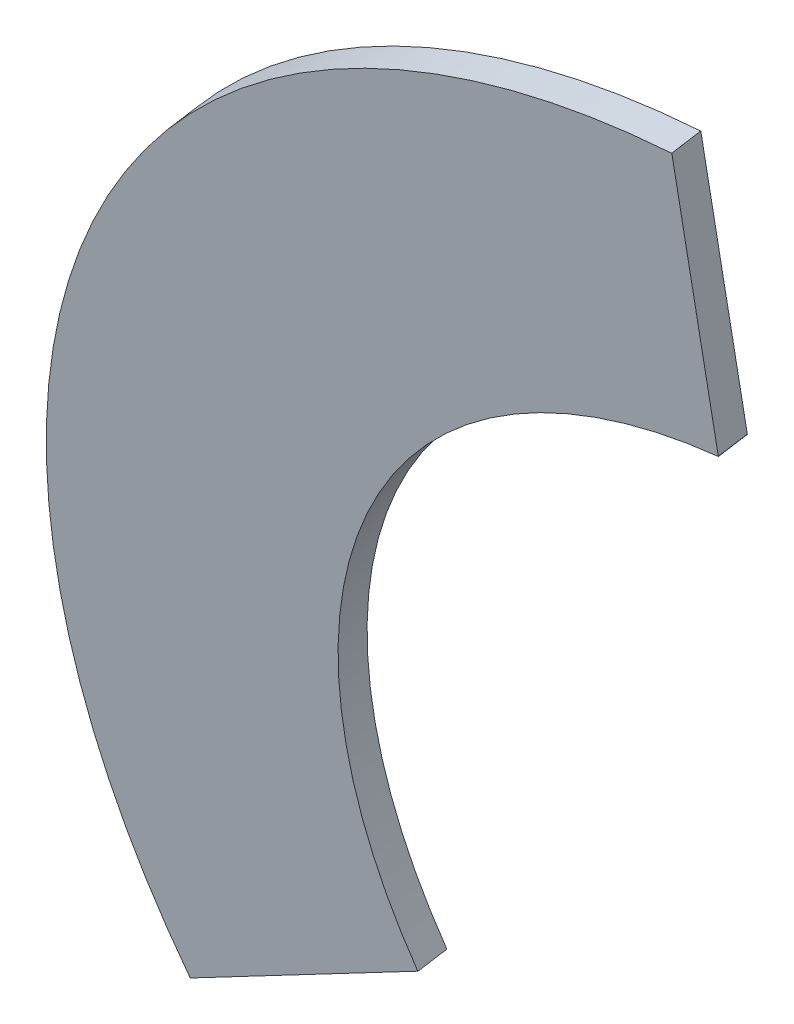
ISO-10303-21;
HEADER;
FILE_DESCRIPTION(('STEP AP214'),'2;1');
FILE_NAME('part.step','',(''),(''),'','','');
FILE_SCHEMA(('AUTOMOTIVE_DESIGN { 1 0 10303 214 1 1 1 1 }'));
ENDSEC;
DATA;
#1=APPLICATION_CONTEXT('core data for automotive mechanical design processes');
#2=APPLICATION_PROTOCOL_DEFINITION('international standard','automotive_design',2000,#1);
#3=PRODUCT_CONTEXT('',#1,'mechanical');
#4=PRODUCT('Part','Part','',(#3));
#5=PRODUCT_RELATED_PRODUCT_CATEGORY('part','',(#4));
#6=PRODUCT_DEFINITION_FORMATION('','',#4);
#7=PRODUCT_DEFINITION_CONTEXT('part definition',#1,'design');
#8=PRODUCT_DEFINITION('design','',#6,#7);
#9=PRODUCT_DEFINITION_SHAPE('','',#8);
#10=(LENGTH_UNIT() NAMED_UNIT(*) SI_UNIT(.MILLI.,.METRE.));
#11=(NAMED_UNIT(*) PLANE_ANGLE_UNIT() SI_UNIT($,.RADIAN.));
#12=(NAMED_UNIT(*) SI_UNIT($,.STERADIAN.) SOLID_ANGLE_UNIT());
#13=UNCERTAINTY_MEASURE_WITH_UNIT(LENGTH_MEASURE(1.E-05),#10,'distance_accuracy_value','');
#14=(GEOMETRIC_REPRESENTATION_CONTEXT(3) GLOBAL_UNCERTAINTY_ASSIGNED_CONTEXT((#13)) GLOBAL_UNIT_ASSIGNED_CONTEXT((#10,
#11,#12)) REPRESENTATION_CONTEXT('',''));
#15=CARTESIAN_POINT('',(0.,0.,0.));
#16=DIRECTION('',(0.,0.,1.));
#17=DIRECTION('',(1.,0.,0.));
#18=AXIS2_PLACEMENT_3D('',#15,#16,#17);
#19=CARTESIAN_POINT('',(-128.717230076169,19.2348660932776,31.7288303444643));
#20=DIRECTION('',(-0.330115174788588,-0.931676294729984,-0.151668234025811));
#21=DIRECTION('',(0.942580577913485,-0.333978822891933,0.));
#22=AXIS2_PLACEMENT_3D('',#19,#20,#21);
#23=PLANE('',#22);
#24=DIRECTION('',(-0.943940660939182,0.325826077430717,0.0530414544654652));
#25=VECTOR('',#24,1.);
#26=CARTESIAN_POINT('',(-128.717230076169,19.3531155455069,31.0024408521984));
#27=LINE('',#26,#25);
#28=CARTESIAN_POINT('',(-128.297401843528,19.2082007305228,30.9788500683638));
#29=VERTEX_POINT('',#28);
#30=CARTESIAN_POINT('',(-128.301400192238,19.2095808662987,30.9790747416296));
#31=VERTEX_POINT('',#30);
#32=EDGE_CURVE('E112',#29,#31,#27,.T.);
#33=ORIENTED_EDGE('',*,*,#32,.F.);
#34=DIRECTION('',(0.,0.160675602081711,-0.987007269930511));
#35=VECTOR('',#34,1.);
#36=CARTESIAN_POINT('',(-128.297401843528,19.0899512782935,31.7052395606297));
#37=LINE('',#36,#35);
#38=CARTESIAN_POINT('',(-128.297401843528,19.0899512782935,31.7052395606297));
#39=VERTEX_POINT('',#38);
#40=EDGE_CURVE('E32',#39,#29,#37,.T.);
#41=ORIENTED_EDGE('',*,*,#40,.F.);
#42=DIRECTION('',(-0.943940660939182,0.325826077430717,0.0530414544654652));
#43=VECTOR('',#42,1.);
#44=CARTESIAN_POINT('',(-128.717230076169,19.2348660932776,31.7288303444643));
#45=LINE('',#44,#43);
#46=CARTESIAN_POINT('',(-128.301400192238,19.0913314140694,31.7054642338955));
#47=VERTEX_POINT('',#46);
#48=EDGE_CURVE('E132',#39,#47,#45,.T.);
#49=ORIENTED_EDGE('',*,*,#48,.T.);
#50=DIRECTION('',(0.,0.160675602081711,-0.987007269930511));
#51=VECTOR('',#50,1.);
#52=CARTESIAN_POINT('',(-128.301400192238,19.0913314140694,31.7054642338955));
#53=LINE('',#52,#51);
#54=EDGE_CURVE('E10',#47,#31,#53,.T.);
#55=ORIENTED_EDGE('',*,*,#54,.T.);
#56=EDGE_LOOP('',(#33,#41,#49,#55));
#57=FACE_BOUND('',#56,.T.);
#58=ADVANCED_FACE('F16',(#57),#23,.T.);
#59=CARTESIAN_POINT('',(-128.301400192238,19.0913314140694,31.7054642338955));
#60=DIRECTION('',(0.5,-0.854773369479747,-0.139149153171122));
#61=DIRECTION('',(0.863170783338306,0.504912070355953,0.));
#62=AXIS2_PLACEMENT_3D('',#59,#60,#61);
#63=PLANE('',#62);
#64=DIRECTION('',(-0.866025403784439,-0.493503634965255,-0.0803378010408555));
#65=VECTOR('',#64,1.);
#66=CARTESIAN_POINT('',(-128.301400192238,19.2095808662987,30.9790747416296));
#67=LINE('',#66,#65);
#68=CARTESIAN_POINT('',(-134.585087941871,15.6288282326239,30.3961615221942));
#69=VERTEX_POINT('',#68);
#70=EDGE_CURVE('E115',#31,#69,#67,.T.);
#71=ORIENTED_EDGE('',*,*,#70,.F.);
#72=ORIENTED_EDGE('',*,*,#54,.F.);
#73=DIRECTION('',(-0.866025403784439,-0.493503634965255,-0.0803378010408555));
#74=VECTOR('',#73,1.);
#75=CARTESIAN_POINT('',(-128.301400192238,19.0913314140694,31.7054642338955));
#76=LINE('',#75,#74);
#77=CARTESIAN_POINT('',(-134.585087941871,15.5105787803945,31.1225510144601));
#78=VERTEX_POINT('',#77);
#79=EDGE_CURVE('E141',#47,#78,#76,.T.);
#80=ORIENTED_EDGE('',*,*,#79,.T.);
#81=DIRECTION('',(0.,0.160675602081711,-0.987007269930511));
#82=VECTOR('',#81,1.);
#83=CARTESIAN_POINT('',(-134.585087941871,15.5105787803945,31.1225510144601));
#84=LINE('',#83,#82);
#85=EDGE_CURVE('E24',#78,#69,#84,.T.);
#86=ORIENTED_EDGE('',*,*,#85,.T.);
#87=EDGE_LOOP('',(#71,#72,#80,#86));
#88=FACE_BOUND('',#87,.T.);
#89=ADVANCED_FACE('F140',(#88),#63,.T.);
#90=CARTESIAN_POINT('',(-134.585087941871,15.5105787803945,31.1225510144601));
#91=DIRECTION('',(-0.951757426285898,0.302864594476862,0.0493035386357682));
#92=DIRECTION('',(-0.303233374468967,-0.952916324032789,0.));
#93=AXIS2_PLACEMENT_3D('',#90,#91,#92);
#94=PLANE('',#93);
#95=DIRECTION('',(0.306851432308279,0.939391498954534,0.152924197504226));
#96=VECTOR('',#95,1.);
#97=CARTESIAN_POINT('',(-134.585087941871,15.6288282326239,30.3961615221942));
#98=LINE('',#97,#96);
#99=CARTESIAN_POINT('',(-134.583585533045,15.6334276899854,30.396910271067));
#100=VERTEX_POINT('',#99);
#101=EDGE_CURVE('E118',#69,#100,#98,.T.);
#102=ORIENTED_EDGE('',*,*,#101,.F.);
#103=ORIENTED_EDGE('',*,*,#85,.F.);
#104=DIRECTION('',(0.306851432308279,0.939391498954534,0.152924197504226));
#105=VECTOR('',#104,1.);
#106=CARTESIAN_POINT('',(-134.585087941871,15.5105787803945,31.1225510144601));
#107=LINE('',#106,#105);
#108=CARTESIAN_POINT('',(-134.583585533045,15.5151782377561,31.1232997633329));
#109=VERTEX_POINT('',#108);
#110=EDGE_CURVE('E150',#78,#109,#107,.T.);
#111=ORIENTED_EDGE('',*,*,#110,.T.);
#112=DIRECTION('',(0.,0.160675602081711,-0.987007269930511));
#113=VECTOR('',#112,1.);
#114=CARTESIAN_POINT('',(-134.583585533045,15.5151782377561,31.1232997633329));
#115=LINE('',#114,#113);
#116=EDGE_CURVE('E138',#109,#100,#115,.T.);
#117=ORIENTED_EDGE('',*,*,#116,.T.);
#118=EDGE_LOOP('',(#102,#103,#111,#117));
#119=FACE_BOUND('',#118,.T.);
#120=ADVANCED_FACE('F145',(#119),#94,.T.);
#121=CARTESIAN_POINT('',(-116.1986852462,24.0891496048619,32.5190625440246));
#122=DIRECTION('',(0.,0.160675602081711,-0.987007269930511));
#123=DIRECTION('',(0.,0.987007269930511,0.160675602081711));
#124=AXIS2_PLACEMENT_3D('',#121,#122,#123);
#125=CYLINDRICAL_SURFACE('',#124,20.3338559378478);
#126=CARTESIAN_POINT('',(-116.1986852462,24.2073990570913,31.7926730517586));
#127=DIRECTION('',(0.,0.160675602081711,-0.987007269930511));
#128=DIRECTION('',(-0.904152185549068,-0.421659885528498,-0.0686423069464996));
#129=AXIS2_PLACEMENT_3D('',#126,#127,#128);
#130=CIRCLE('',#129,20.3338559378478);
#131=CARTESIAN_POINT('',(-117.868113785377,44.2093079063799,35.0487977481544));
#132=VERTEX_POINT('',#131);
#133=EDGE_CURVE('E121',#100,#132,#130,.T.);
#134=ORIENTED_EDGE('',*,*,#133,.F.);
#135=ORIENTED_EDGE('',*,*,#116,.F.);
#136=CARTESIAN_POINT('',(-116.1986852462,24.0891496048619,32.5190625440246));
#137=DIRECTION('',(0.,0.160675602081711,-0.987007269930511));
#138=DIRECTION('',(-0.904152185549068,-0.421659885528498,-0.0686423069464996));
#139=AXIS2_PLACEMENT_3D('',#136,#137,#138);
#140=CIRCLE('',#139,20.3338559378478);
#141=CARTESIAN_POINT('',(-117.868113785377,44.0910584541505,35.7751872404204));
#142=VERTEX_POINT('',#141);
#143=EDGE_CURVE('E154',#109,#142,#140,.T.);
#144=ORIENTED_EDGE('',*,*,#143,.T.);
#145=DIRECTION('',(0.,0.160675602081711,-0.987007269930511));
#146=VECTOR('',#145,1.);
#147=CARTESIAN_POINT('',(-117.868113785377,44.0910584541505,35.7751872404204));
#148=LINE('',#147,#146);
#149=EDGE_CURVE('E136',#142,#132,#148,.T.);
#150=ORIENTED_EDGE('',*,*,#149,.T.);
#151=EDGE_LOOP('',(#134,#135,#144,#150));
#152=FACE_BOUND('',#151,.T.);
#153=ADVANCED_FACE('F161',(#152),#125,.T.);
#154=CARTESIAN_POINT('',(-118.1986852462,43.7303462831371,35.7164666544415));
#155=DIRECTION('',(-0.741619848709575,0.662104604955322,0.107784470574122));
#156=DIRECTION('',(-0.665984440854605,-0.745965632277774,0.));
#157=AXIS2_PLACEMENT_3D('',#154,#155,#156);
#158=PLANE('',#157);
#159=DIRECTION('',(0.670820393249927,0.731984182201115,0.119160215707166));
#160=VECTOR('',#159,1.);
#161=CARTESIAN_POINT('',(-118.1986852462,43.8485957353665,34.9900771621755));
#162=LINE('',#161,#160);
#163=CARTESIAN_POINT('',(-117.864829308352,44.2128918541153,35.0493811815067));
#164=VERTEX_POINT('',#163);
#165=EDGE_CURVE('E124',#132,#164,#162,.T.);
#166=ORIENTED_EDGE('',*,*,#165,.F.);
#167=ORIENTED_EDGE('',*,*,#149,.F.);
#168=DIRECTION('',(0.670820393249927,0.731984182201115,0.119160215707166));
#169=VECTOR('',#168,1.);
#170=CARTESIAN_POINT('',(-118.1986852462,43.7303462831371,35.7164666544415));
#171=LINE('',#170,#169);
#172=CARTESIAN_POINT('',(-117.864829308352,44.0946424018859,35.7757706737727));
#173=VERTEX_POINT('',#172);
#174=EDGE_CURVE('E103',#142,#173,#171,.T.);
#175=ORIENTED_EDGE('',*,*,#174,.T.);
#176=DIRECTION('',(0.,0.160675602081711,-0.987007269930511));
#177=VECTOR('',#176,1.);
#178=CARTESIAN_POINT('',(-117.864829308352,44.0946424018859,35.7757706737727));
#179=LINE('',#178,#177);
#180=EDGE_CURVE('E95',#173,#164,#179,.T.);
#181=ORIENTED_EDGE('',*,*,#180,.T.);
#182=EDGE_LOOP('',(#166,#167,#175,#181));
#183=FACE_BOUND('',#182,.T.);
#184=ADVANCED_FACE('F158',(#183),#158,.T.);
#185=CARTESIAN_POINT('',(-117.864829308352,44.094642401886,35.7757706737727));
#186=DIRECTION('',(1.,0.,0.));
#187=DIRECTION('',(0.,0.,-1.));
#188=AXIS2_PLACEMENT_3D('',#185,#186,#187);
#189=PLANE('',#188);
#190=DIRECTION('',(0.,-0.98700726993051,-0.160675602081711));
#191=VECTOR('',#190,1.);
#192=CARTESIAN_POINT('',(-117.864829308352,44.2128918541153,35.0493811815067));
#193=LINE('',#192,#191);
#194=CARTESIAN_POINT('',(-117.864829308352,37.0513865867658,33.8835547426359));
#195=VERTEX_POINT('',#194);
#196=EDGE_CURVE('E127',#164,#195,#193,.T.);
#197=ORIENTED_EDGE('',*,*,#196,.F.);
#198=ORIENTED_EDGE('',*,*,#180,.F.);
#199=DIRECTION('',(0.,-0.98700726993051,-0.160675602081711));
#200=VECTOR('',#199,1.);
#201=CARTESIAN_POINT('',(-117.864829308352,44.094642401886,35.7757706737727));
#202=LINE('',#201,#200);
#203=CARTESIAN_POINT('',(-117.864829308352,36.9331371345365,34.6099442349018));
#204=VERTEX_POINT('',#203);
#205=EDGE_CURVE('E98',#173,#204,#202,.T.);
#206=ORIENTED_EDGE('',*,*,#205,.T.);
#207=DIRECTION('',(0.,0.160675602081711,-0.987007269930511));
#208=VECTOR('',#207,1.);
#209=CARTESIAN_POINT('',(-117.864829308352,36.9331371345365,34.6099442349018));
#210=LINE('',#209,#208);
#211=EDGE_CURVE('E84',#204,#195,#210,.T.);
#212=ORIENTED_EDGE('',*,*,#211,.T.);
#213=EDGE_LOOP('',(#197,#198,#206,#212));
#214=FACE_BOUND('',#213,.T.);
#215=ADVANCED_FACE('F99',(#214),#189,.T.);
#216=CARTESIAN_POINT('',(-118.1986852462,37.2168101059499,34.6561235558296));
#217=DIRECTION('',(0.652419004644113,0.748011807635428,0.121769364033674));
#218=DIRECTION('',(-0.753619928776211,0.657310431190118,0.));
#219=AXIS2_PLACEMENT_3D('',#216,#217,#218);
#220=PLANE('',#219);
#221=DIRECTION('',(0.757858458011247,-0.643942300624568,-0.104827816380737));
#222=VECTOR('',#221,1.);
#223=CARTESIAN_POINT('',(-118.1986852462,37.3350595581793,33.9297340635636));
#224=LINE('',#223,#222);
#225=CARTESIAN_POINT('',(-117.861619167595,37.0486589726544,33.8831107124317));
#226=VERTEX_POINT('',#225);
#227=EDGE_CURVE('E91',#195,#226,#224,.T.);
#228=ORIENTED_EDGE('',*,*,#227,.F.);
#229=ORIENTED_EDGE('',*,*,#211,.F.);
#230=DIRECTION('',(0.757858458011247,-0.643942300624568,-0.104827816380737));
#231=VECTOR('',#230,1.);
#232=CARTESIAN_POINT('',(-118.1986852462,37.2168101059499,34.6561235558296));
#233=LINE('',#232,#231);
#234=CARTESIAN_POINT('',(-117.861619167595,36.930409520425,34.6095002046976));
#235=VERTEX_POINT('',#234);
#236=EDGE_CURVE('E88',#204,#235,#233,.T.);
#237=ORIENTED_EDGE('',*,*,#236,.T.);
#238=DIRECTION('',(0.,0.160675602081711,-0.987007269930511));
#239=VECTOR('',#238,1.);
#240=CARTESIAN_POINT('',(-117.861619167595,36.930409520425,34.6095002046976));
#241=LINE('',#240,#239);
#242=EDGE_CURVE('E60',#235,#226,#241,.T.);
#243=ORIENTED_EDGE('',*,*,#242,.T.);
#244=EDGE_LOOP('',(#228,#229,#237,#243));
#245=FACE_BOUND('',#244,.T.);
#246=ADVANCED_FACE('F86',(#245),#220,.T.);
#247=CARTESIAN_POINT('',(-116.1986852462,24.089149604862,32.5190625440246));
#248=DIRECTION('',(0.,0.160675602081711,-0.987007269930511));
#249=DIRECTION('',(0.,0.987007269930511,0.160675602081711));
#250=AXIS2_PLACEMENT_3D('',#247,#248,#249);
#251=CYLINDRICAL_SURFACE('',#250,13.1161440621522);
#252=CARTESIAN_POINT('',(-116.1986852462,24.2073990570914,31.7926730517586));
#253=DIRECTION('',(0.,-0.160675602081711,0.987007269930511));
#254=DIRECTION('',(-0.126785274202157,0.979042305018406,0.159378979886717));
#255=AXIS2_PLACEMENT_3D('',#252,#253,#254);
#256=CIRCLE('',#255,13.1161440621522);
#257=EDGE_CURVE('E130',#226,#29,#256,.T.);
#258=ORIENTED_EDGE('',*,*,#257,.F.);
#259=ORIENTED_EDGE('',*,*,#242,.F.);
#260=CARTESIAN_POINT('',(-116.1986852462,24.089149604862,32.5190625440246));
#261=DIRECTION('',(0.,-0.160675602081711,0.987007269930511));
#262=DIRECTION('',(-0.126785274202157,0.979042305018406,0.159378979886717));
#263=AXIS2_PLACEMENT_3D('',#260,#261,#262);
#264=CIRCLE('',#263,13.1161440621522);
#265=EDGE_CURVE('E107',#235,#39,#264,.T.);
#266=ORIENTED_EDGE('',*,*,#265,.T.);
#267=ORIENTED_EDGE('',*,*,#40,.T.);
#268=EDGE_LOOP('',(#258,#259,#266,#267));
#269=FACE_BOUND('',#268,.T.);
#270=ADVANCED_FACE('F213',(#269),#251,.F.);
#271=CARTESIAN_POINT('',(-116.1986852462,-0.868410127831424,28.4562039828884));
#272=DIRECTION('',(0.,0.160675602081711,-0.98700726993051));
#273=DIRECTION('',(-1.,0.,0.));
#274=AXIS2_PLACEMENT_3D('',#271,#272,#273);
#275=PLANE('',#274);
#276=ORIENTED_EDGE('',*,*,#48,.F.);
#277=ORIENTED_EDGE('',*,*,#265,.F.);
#278=ORIENTED_EDGE('',*,*,#236,.F.);
#279=ORIENTED_EDGE('',*,*,#205,.F.);
#280=ORIENTED_EDGE('',*,*,#174,.F.);
#281=ORIENTED_EDGE('',*,*,#143,.F.);
#282=ORIENTED_EDGE('',*,*,#110,.F.);
#283=ORIENTED_EDGE('',*,*,#79,.F.);
#284=EDGE_LOOP('',(#276,#277,#278,#279,#280,#281,#282,#283));
#285=FACE_BOUND('',#284,.T.);
#286=ADVANCED_FACE('F106',(#285),#275,.F.);
#287=CARTESIAN_POINT('',(-116.1986852462,-0.750160675602082,27.7298144906225));
#288=DIRECTION('',(0.,0.160675602081711,-0.98700726993051));
#289=DIRECTION('',(-1.,0.,0.));
#290=AXIS2_PLACEMENT_3D('',#287,#288,#289);
#291=PLANE('',#290);
#292=ORIENTED_EDGE('',*,*,#32,.T.);
#293=ORIENTED_EDGE('',*,*,#70,.T.);
#294=ORIENTED_EDGE('',*,*,#101,.T.);
#295=ORIENTED_EDGE('',*,*,#133,.T.);
#296=ORIENTED_EDGE('',*,*,#165,.T.);
#297=ORIENTED_EDGE('',*,*,#196,.T.);
#298=ORIENTED_EDGE('',*,*,#227,.T.);
#299=ORIENTED_EDGE('',*,*,#257,.T.);
#300=EDGE_LOOP('',(#292,#293,#294,#295,#296,#297,#298,#299));
#301=FACE_BOUND('',#300,.T.);
#302=ADVANCED_FACE('F148',(#301),#291,.T.);
#303=CLOSED_SHELL('',(#58,#89,#120,#153,#184,#215,#246,#270,#286,#302));
#304=MANIFOLD_SOLID_BREP('B1',#303);
#305=ADVANCED_BREP_SHAPE_REPRESENTATION('',(#18,#304),#14);
#306=SHAPE_DEFINITION_REPRESENTATION(#9,#305);
ENDSEC;
END-ISO-10303-21;
